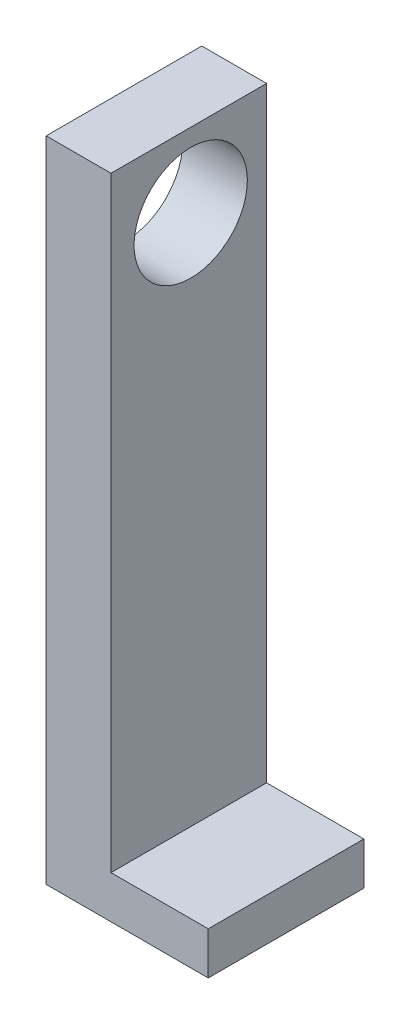
ISO-10303-21;
HEADER;
FILE_DESCRIPTION(('STEP AP214'),'2;1');
FILE_NAME('part.step','',(''),(''),'','','');
FILE_SCHEMA(('AUTOMOTIVE_DESIGN { 1 0 10303 214 1 1 1 1 }'));
ENDSEC;
DATA;
#1=APPLICATION_CONTEXT('core data for automotive mechanical design processes');
#2=APPLICATION_PROTOCOL_DEFINITION('international standard','automotive_design',2000,#1);
#3=PRODUCT_CONTEXT('',#1,'mechanical');
#4=PRODUCT('Part','Part','',(#3));
#5=PRODUCT_RELATED_PRODUCT_CATEGORY('part','',(#4));
#6=PRODUCT_DEFINITION_FORMATION('','',#4);
#7=PRODUCT_DEFINITION_CONTEXT('part definition',#1,'design');
#8=PRODUCT_DEFINITION('design','',#6,#7);
#9=PRODUCT_DEFINITION_SHAPE('','',#8);
#10=(LENGTH_UNIT() NAMED_UNIT(*) SI_UNIT(.MILLI.,.METRE.));
#11=(NAMED_UNIT(*) PLANE_ANGLE_UNIT() SI_UNIT($,.RADIAN.));
#12=(NAMED_UNIT(*) SI_UNIT($,.STERADIAN.) SOLID_ANGLE_UNIT());
#13=UNCERTAINTY_MEASURE_WITH_UNIT(LENGTH_MEASURE(1.E-05),#10,'distance_accuracy_value','');
#14=(GEOMETRIC_REPRESENTATION_CONTEXT(3) GLOBAL_UNCERTAINTY_ASSIGNED_CONTEXT((#13)) GLOBAL_UNIT_ASSIGNED_CONTEXT((#10,
#11,#12)) REPRESENTATION_CONTEXT('',''));
#15=CARTESIAN_POINT('',(0.,0.,0.));
#16=DIRECTION('',(0.,0.,1.));
#17=DIRECTION('',(1.,0.,0.));
#18=AXIS2_PLACEMENT_3D('',#15,#16,#17);
#19=CARTESIAN_POINT('',(10.,0.,0.));
#20=DIRECTION('',(-1.,0.,0.));
#21=DIRECTION('',(0.,0.,1.));
#22=AXIS2_PLACEMENT_3D('',#19,#20,#21);
#23=PLANE('',#22);
#24=CARTESIAN_POINT('',(10.,0.,0.));
#25=DIRECTION('',(1.,0.,0.));
#26=DIRECTION('',(0.,0.,-1.));
#27=AXIS2_PLACEMENT_3D('',#24,#25,#26);
#28=CIRCLE('',#27,8.735);
#29=CARTESIAN_POINT('',(10.,0.,-8.735));
#30=VERTEX_POINT('',#29);
#31=EDGE_CURVE('E104',#30,#30,#28,.T.);
#32=ORIENTED_EDGE('',*,*,#31,.F.);
#33=EDGE_LOOP('',(#32));
#34=FACE_BOUND('',#33,.T.);
#35=DIRECTION('',(0.,0.,1.));
#36=VECTOR('',#35,1.);
#37=CARTESIAN_POINT('',(10.,-82.,12.2981423762519));
#38=LINE('',#37,#36);
#39=CARTESIAN_POINT('',(10.,-82.,-11.7018576237481));
#40=VERTEX_POINT('',#39);
#41=CARTESIAN_POINT('',(10.,-82.,12.2981423762519));
#42=VERTEX_POINT('',#41);
#43=EDGE_CURVE('E50',#40,#42,#38,.T.);
#44=ORIENTED_EDGE('',*,*,#43,.F.);
#45=DIRECTION('',(0.,1.,0.));
#46=VECTOR('',#45,1.);
#47=CARTESIAN_POINT('',(10.,-88.5734739219889,-11.7018576237481));
#48=LINE('',#47,#46);
#49=CARTESIAN_POINT('',(10.,11.4265260780111,-11.7018576237481));
#50=VERTEX_POINT('',#49);
#51=EDGE_CURVE('E88',#40,#50,#48,.T.);
#52=ORIENTED_EDGE('',*,*,#51,.T.);
#53=DIRECTION('',(0.,0.,1.));
#54=VECTOR('',#53,1.);
#55=CARTESIAN_POINT('',(10.,11.4265260780111,12.2981423762519));
#56=LINE('',#55,#54);
#57=CARTESIAN_POINT('',(10.,11.4265260780111,12.2981423762519));
#58=VERTEX_POINT('',#57);
#59=EDGE_CURVE('E56',#50,#58,#56,.T.);
#60=ORIENTED_EDGE('',*,*,#59,.T.);
#61=DIRECTION('',(0.,-1.,0.));
#62=VECTOR('',#61,1.);
#63=CARTESIAN_POINT('',(10.,-88.5734739219889,12.2981423762519));
#64=LINE('',#63,#62);
#65=EDGE_CURVE('E99',#58,#42,#64,.T.);
#66=ORIENTED_EDGE('',*,*,#65,.T.);
#67=EDGE_LOOP('',(#44,#52,#60,#66));
#68=FACE_BOUND('',#67,.T.);
#69=ADVANCED_FACE('F35',(#34,#68),#23,.F.);
#70=CARTESIAN_POINT('',(0.,0.,0.));
#71=DIRECTION('',(-1.,0.,0.));
#72=DIRECTION('',(0.,0.,1.));
#73=AXIS2_PLACEMENT_3D('',#70,#71,#72);
#74=PLANE('',#73);
#75=DIRECTION('',(0.,1.,0.));
#76=VECTOR('',#75,1.);
#77=CARTESIAN_POINT('',(0.,-88.5734739219889,-11.7018576237481));
#78=LINE('',#77,#76);
#79=CARTESIAN_POINT('',(0.,-88.5734739219889,-11.7018576237481));
#80=VERTEX_POINT('',#79);
#81=CARTESIAN_POINT('',(0.,11.4265260780111,-11.7018576237481));
#82=VERTEX_POINT('',#81);
#83=EDGE_CURVE('E95',#80,#82,#78,.T.);
#84=ORIENTED_EDGE('',*,*,#83,.F.);
#85=DIRECTION('',(0.,0.,-1.));
#86=VECTOR('',#85,1.);
#87=CARTESIAN_POINT('',(0.,-88.5734739219889,12.2981423762519));
#88=LINE('',#87,#86);
#89=CARTESIAN_POINT('',(0.,-88.5734739219889,12.2981423762519));
#90=VERTEX_POINT('',#89);
#91=EDGE_CURVE('E76',#90,#80,#88,.T.);
#92=ORIENTED_EDGE('',*,*,#91,.F.);
#93=DIRECTION('',(0.,-1.,0.));
#94=VECTOR('',#93,1.);
#95=CARTESIAN_POINT('',(0.,-88.5734739219889,12.2981423762519));
#96=LINE('',#95,#94);
#97=CARTESIAN_POINT('',(0.,11.4265260780111,12.2981423762519));
#98=VERTEX_POINT('',#97);
#99=EDGE_CURVE('E89',#98,#90,#96,.T.);
#100=ORIENTED_EDGE('',*,*,#99,.F.);
#101=DIRECTION('',(0.,0.,1.));
#102=VECTOR('',#101,1.);
#103=CARTESIAN_POINT('',(0.,11.4265260780111,12.2981423762519));
#104=LINE('',#103,#102);
#105=EDGE_CURVE('E103',#82,#98,#104,.T.);
#106=ORIENTED_EDGE('',*,*,#105,.F.);
#107=EDGE_LOOP('',(#84,#92,#100,#106));
#108=FACE_BOUND('',#107,.T.);
#109=CARTESIAN_POINT('',(0.,0.,0.));
#110=DIRECTION('',(1.,0.,0.));
#111=DIRECTION('',(0.,0.,-1.));
#112=AXIS2_PLACEMENT_3D('',#109,#110,#111);
#113=CIRCLE('',#112,8.735);
#114=CARTESIAN_POINT('',(0.,0.,-8.735));
#115=VERTEX_POINT('',#114);
#116=EDGE_CURVE('E108',#115,#115,#113,.T.);
#117=ORIENTED_EDGE('',*,*,#116,.T.);
#118=EDGE_LOOP('',(#117));
#119=FACE_BOUND('',#118,.T.);
#120=ADVANCED_FACE('F101',(#108,#119),#74,.T.);
#121=CARTESIAN_POINT('',(10.,-88.5734739219889,-11.7018576237481));
#122=DIRECTION('',(0.,0.,1.));
#123=DIRECTION('',(1.,0.,0.));
#124=AXIS2_PLACEMENT_3D('',#121,#122,#123);
#125=PLANE('',#124);
#126=ORIENTED_EDGE('',*,*,#83,.T.);
#127=DIRECTION('',(-1.,0.,0.));
#128=VECTOR('',#127,1.);
#129=CARTESIAN_POINT('',(10.,11.4265260780111,-11.7018576237481));
#130=LINE('',#129,#128);
#131=EDGE_CURVE('E11',#50,#82,#130,.T.);
#132=ORIENTED_EDGE('',*,*,#131,.F.);
#133=ORIENTED_EDGE('',*,*,#51,.F.);
#134=DIRECTION('',(-1.,0.,0.));
#135=VECTOR('',#134,1.);
#136=CARTESIAN_POINT('',(25.,-82.,-11.7018576237481));
#137=LINE('',#136,#135);
#138=CARTESIAN_POINT('',(25.,-82.,-11.7018576237481));
#139=VERTEX_POINT('',#138);
#140=EDGE_CURVE('E123',#139,#40,#137,.T.);
#141=ORIENTED_EDGE('',*,*,#140,.F.);
#142=DIRECTION('',(0.,1.,0.));
#143=VECTOR('',#142,1.);
#144=CARTESIAN_POINT('',(25.,-88.5734739219889,-11.7018576237481));
#145=LINE('',#144,#143);
#146=CARTESIAN_POINT('',(25.,-88.5734739219889,-11.7018576237481));
#147=VERTEX_POINT('',#146);
#148=EDGE_CURVE('E98',#147,#139,#145,.T.);
#149=ORIENTED_EDGE('',*,*,#148,.F.);
#150=DIRECTION('',(-1.,0.,0.));
#151=VECTOR('',#150,1.);
#152=CARTESIAN_POINT('',(10.,-88.5734739219889,-11.7018576237481));
#153=LINE('',#152,#151);
#154=EDGE_CURVE('E81',#147,#80,#153,.T.);
#155=ORIENTED_EDGE('',*,*,#154,.T.);
#156=EDGE_LOOP('',(#126,#132,#133,#141,#149,#155));
#157=FACE_BOUND('',#156,.T.);
#158=ADVANCED_FACE('F37',(#157),#125,.F.);
#159=CARTESIAN_POINT('',(10.,11.4265260780111,12.2981423762519));
#160=DIRECTION('',(0.,-1.,0.));
#161=DIRECTION('',(0.,0.,-1.));
#162=AXIS2_PLACEMENT_3D('',#159,#160,#161);
#163=PLANE('',#162);
#164=ORIENTED_EDGE('',*,*,#105,.T.);
#165=DIRECTION('',(-1.,0.,0.));
#166=VECTOR('',#165,1.);
#167=CARTESIAN_POINT('',(10.,11.4265260780111,12.2981423762519));
#168=LINE('',#167,#166);
#169=EDGE_CURVE('E43',#58,#98,#168,.T.);
#170=ORIENTED_EDGE('',*,*,#169,.F.);
#171=ORIENTED_EDGE('',*,*,#59,.F.);
#172=ORIENTED_EDGE('',*,*,#131,.T.);
#173=EDGE_LOOP('',(#164,#170,#171,#172));
#174=FACE_BOUND('',#173,.T.);
#175=ADVANCED_FACE('F120',(#174),#163,.F.);
#176=CARTESIAN_POINT('',(10.,-88.5734739219889,12.2981423762519));
#177=DIRECTION('',(0.,0.,-1.));
#178=DIRECTION('',(-1.,0.,0.));
#179=AXIS2_PLACEMENT_3D('',#176,#177,#178);
#180=PLANE('',#179);
#181=ORIENTED_EDGE('',*,*,#99,.T.);
#182=DIRECTION('',(-1.,0.,0.));
#183=VECTOR('',#182,1.);
#184=CARTESIAN_POINT('',(10.,-88.5734739219889,12.2981423762519));
#185=LINE('',#184,#183);
#186=CARTESIAN_POINT('',(25.,-88.5734739219889,12.2981423762519));
#187=VERTEX_POINT('',#186);
#188=EDGE_CURVE('E84',#187,#90,#185,.T.);
#189=ORIENTED_EDGE('',*,*,#188,.F.);
#190=DIRECTION('',(0.,-1.,0.));
#191=VECTOR('',#190,1.);
#192=CARTESIAN_POINT('',(25.,-88.5734739219889,12.2981423762519));
#193=LINE('',#192,#191);
#194=CARTESIAN_POINT('',(25.,-82.,12.2981423762519));
#195=VERTEX_POINT('',#194);
#196=EDGE_CURVE('E149',#195,#187,#193,.T.);
#197=ORIENTED_EDGE('',*,*,#196,.F.);
#198=DIRECTION('',(-1.,0.,0.));
#199=VECTOR('',#198,1.);
#200=CARTESIAN_POINT('',(25.,-82.,12.2981423762519));
#201=LINE('',#200,#199);
#202=EDGE_CURVE('E132',#195,#42,#201,.T.);
#203=ORIENTED_EDGE('',*,*,#202,.T.);
#204=ORIENTED_EDGE('',*,*,#65,.F.);
#205=ORIENTED_EDGE('',*,*,#169,.T.);
#206=EDGE_LOOP('',(#181,#189,#197,#203,#204,#205));
#207=FACE_BOUND('',#206,.T.);
#208=ADVANCED_FACE('F117',(#207),#180,.F.);
#209=CARTESIAN_POINT('',(10.,-88.5734739219889,12.2981423762519));
#210=DIRECTION('',(0.,1.,0.));
#211=DIRECTION('',(0.,0.,1.));
#212=AXIS2_PLACEMENT_3D('',#209,#210,#211);
#213=PLANE('',#212);
#214=ORIENTED_EDGE('',*,*,#91,.T.);
#215=ORIENTED_EDGE('',*,*,#154,.F.);
#216=DIRECTION('',(0.,0.,-1.));
#217=VECTOR('',#216,1.);
#218=CARTESIAN_POINT('',(25.,-88.5734739219889,12.2981423762519));
#219=LINE('',#218,#217);
#220=EDGE_CURVE('E146',#187,#147,#219,.T.);
#221=ORIENTED_EDGE('',*,*,#220,.F.);
#222=ORIENTED_EDGE('',*,*,#188,.T.);
#223=EDGE_LOOP('',(#214,#215,#221,#222));
#224=FACE_BOUND('',#223,.T.);
#225=ADVANCED_FACE('F78',(#224),#213,.F.);
#226=CARTESIAN_POINT('',(10.,0.,0.));
#227=DIRECTION('',(-1.,0.,0.));
#228=DIRECTION('',(0.,0.,1.));
#229=AXIS2_PLACEMENT_3D('',#226,#227,#228);
#230=CYLINDRICAL_SURFACE('',#229,8.735);
#231=ORIENTED_EDGE('',*,*,#31,.T.);
#232=EDGE_LOOP('',(#231));
#233=FACE_BOUND('',#232,.T.);
#234=ORIENTED_EDGE('',*,*,#116,.F.);
#235=EDGE_LOOP('',(#234));
#236=FACE_BOUND('',#235,.T.);
#237=ADVANCED_FACE('F158',(#233,#236),#230,.F.);
#238=CARTESIAN_POINT('',(25.,-82.,12.2981423762519));
#239=DIRECTION('',(0.,-1.,0.));
#240=DIRECTION('',(0.,0.,-1.));
#241=AXIS2_PLACEMENT_3D('',#238,#239,#240);
#242=PLANE('',#241);
#243=ORIENTED_EDGE('',*,*,#43,.T.);
#244=ORIENTED_EDGE('',*,*,#202,.F.);
#245=DIRECTION('',(0.,0.,1.));
#246=VECTOR('',#245,1.);
#247=CARTESIAN_POINT('',(25.,-82.,12.2981423762519));
#248=LINE('',#247,#246);
#249=EDGE_CURVE('E131',#139,#195,#248,.T.);
#250=ORIENTED_EDGE('',*,*,#249,.F.);
#251=ORIENTED_EDGE('',*,*,#140,.T.);
#252=EDGE_LOOP('',(#243,#244,#250,#251));
#253=FACE_BOUND('',#252,.T.);
#254=ADVANCED_FACE('F127',(#253),#242,.F.);
#255=CARTESIAN_POINT('',(25.,0.,0.));
#256=DIRECTION('',(-1.,0.,0.));
#257=DIRECTION('',(0.,0.,1.));
#258=AXIS2_PLACEMENT_3D('',#255,#256,#257);
#259=PLANE('',#258);
#260=ORIENTED_EDGE('',*,*,#196,.T.);
#261=ORIENTED_EDGE('',*,*,#220,.T.);
#262=ORIENTED_EDGE('',*,*,#148,.T.);
#263=ORIENTED_EDGE('',*,*,#249,.T.);
#264=EDGE_LOOP('',(#260,#261,#262,#263));
#265=FACE_BOUND('',#264,.T.);
#266=ADVANCED_FACE('F145',(#265),#259,.F.);
#267=CLOSED_SHELL('',(#69,#120,#158,#175,#208,#225,#237,#254,#266));
#268=MANIFOLD_SOLID_BREP('B2',#267);
#269=ADVANCED_BREP_SHAPE_REPRESENTATION('',(#18,#268),#14);
#270=SHAPE_DEFINITION_REPRESENTATION(#9,#269);
ENDSEC;
END-ISO-10303-21;
